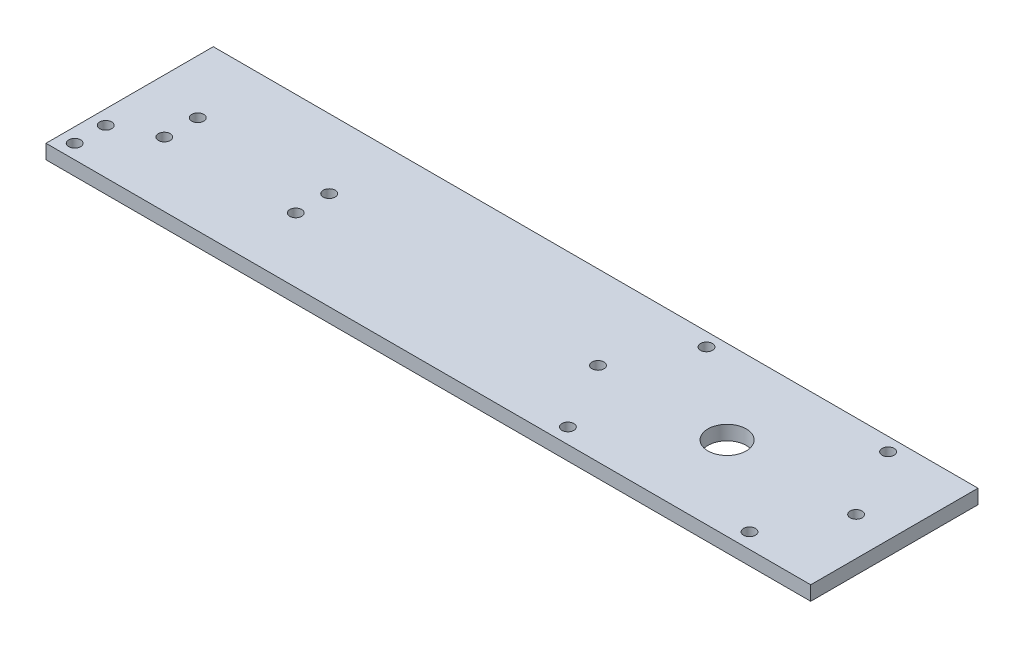
ISO-10303-21;
HEADER;
FILE_DESCRIPTION(('STEP AP214'),'2;1');
FILE_NAME('part.step','',(''),(''),'','','');
FILE_SCHEMA(('AUTOMOTIVE_DESIGN { 1 0 10303 214 1 1 1 1 }'));
ENDSEC;
DATA;
#1=APPLICATION_CONTEXT('core data for automotive mechanical design processes');
#2=APPLICATION_PROTOCOL_DEFINITION('international standard','automotive_design',2000,#1);
#3=PRODUCT_CONTEXT('',#1,'mechanical');
#4=PRODUCT('Part','Part','',(#3));
#5=PRODUCT_RELATED_PRODUCT_CATEGORY('part','',(#4));
#6=PRODUCT_DEFINITION_FORMATION('','',#4);
#7=PRODUCT_DEFINITION_CONTEXT('part definition',#1,'design');
#8=PRODUCT_DEFINITION('design','',#6,#7);
#9=PRODUCT_DEFINITION_SHAPE('','',#8);
#10=(LENGTH_UNIT() NAMED_UNIT(*) SI_UNIT(.MILLI.,.METRE.));
#11=(NAMED_UNIT(*) PLANE_ANGLE_UNIT() SI_UNIT($,.RADIAN.));
#12=(NAMED_UNIT(*) SI_UNIT($,.STERADIAN.) SOLID_ANGLE_UNIT());
#13=UNCERTAINTY_MEASURE_WITH_UNIT(LENGTH_MEASURE(1.E-05),#10,'distance_accuracy_value','');
#14=(GEOMETRIC_REPRESENTATION_CONTEXT(3) GLOBAL_UNCERTAINTY_ASSIGNED_CONTEXT((#13)) GLOBAL_UNIT_ASSIGNED_CONTEXT((#10,
#11,#12)) REPRESENTATION_CONTEXT('',''));
#15=CARTESIAN_POINT('',(0.,0.,0.));
#16=DIRECTION('',(0.,0.,1.));
#17=DIRECTION('',(1.,0.,0.));
#18=AXIS2_PLACEMENT_3D('',#15,#16,#17);
#19=CARTESIAN_POINT('',(0.,3.,12.5));
#20=DIRECTION('',(0.,0.,-1.));
#21=DIRECTION('',(-1.,0.,0.));
#22=AXIS2_PLACEMENT_3D('',#19,#20,#21);
#23=PLANE('',#22);
#24=DIRECTION('',(1.,0.,0.));
#25=VECTOR('',#24,1.);
#26=CARTESIAN_POINT('',(0.,0.,12.5));
#27=LINE('',#26,#25);
#28=CARTESIAN_POINT('',(-100.,0.,12.5));
#29=VERTEX_POINT('',#28);
#30=CARTESIAN_POINT('',(60.,0.,12.5));
#31=VERTEX_POINT('',#30);
#32=EDGE_CURVE('E150',#29,#31,#27,.T.);
#33=ORIENTED_EDGE('',*,*,#32,.T.);
#34=DIRECTION('',(0.,-1.,0.));
#35=VECTOR('',#34,1.);
#36=CARTESIAN_POINT('',(60.,3.,12.5));
#37=LINE('',#36,#35);
#38=CARTESIAN_POINT('',(60.,3.,12.5));
#39=VERTEX_POINT('',#38);
#40=EDGE_CURVE('E11',#39,#31,#37,.T.);
#41=ORIENTED_EDGE('',*,*,#40,.F.);
#42=DIRECTION('',(1.,0.,0.));
#43=VECTOR('',#42,1.);
#44=CARTESIAN_POINT('',(0.,3.,12.5));
#45=LINE('',#44,#43);
#46=CARTESIAN_POINT('',(-100.,3.,12.5));
#47=VERTEX_POINT('',#46);
#48=EDGE_CURVE('E85',#47,#39,#45,.T.);
#49=ORIENTED_EDGE('',*,*,#48,.F.);
#50=DIRECTION('',(0.,-1.,0.));
#51=VECTOR('',#50,1.);
#52=CARTESIAN_POINT('',(-100.,3.,12.5));
#53=LINE('',#52,#51);
#54=EDGE_CURVE('E149',#47,#29,#53,.T.);
#55=ORIENTED_EDGE('',*,*,#54,.T.);
#56=EDGE_LOOP('',(#33,#41,#49,#55));
#57=FACE_BOUND('',#56,.T.);
#58=ADVANCED_FACE('F43',(#57),#23,.F.);
#59=CARTESIAN_POINT('',(60.,3.,0.));
#60=DIRECTION('',(1.,0.,0.));
#61=DIRECTION('',(0.,0.,-1.));
#62=AXIS2_PLACEMENT_3D('',#59,#60,#61);
#63=PLANE('',#62);
#64=DIRECTION('',(0.,0.,1.));
#65=VECTOR('',#64,1.);
#66=CARTESIAN_POINT('',(60.,0.,0.));
#67=LINE('',#66,#65);
#68=CARTESIAN_POINT('',(60.,0.,-22.5));
#69=VERTEX_POINT('',#68);
#70=EDGE_CURVE('E94',#69,#31,#67,.T.);
#71=ORIENTED_EDGE('',*,*,#70,.F.);
#72=DIRECTION('',(0.,-1.,0.));
#73=VECTOR('',#72,1.);
#74=CARTESIAN_POINT('',(60.,3.,-22.5));
#75=LINE('',#74,#73);
#76=CARTESIAN_POINT('',(60.,3.,-22.5));
#77=VERTEX_POINT('',#76);
#78=EDGE_CURVE('E53',#77,#69,#75,.T.);
#79=ORIENTED_EDGE('',*,*,#78,.F.);
#80=DIRECTION('',(0.,0.,1.));
#81=VECTOR('',#80,1.);
#82=CARTESIAN_POINT('',(60.,3.,0.));
#83=LINE('',#82,#81);
#84=EDGE_CURVE('E92',#77,#39,#83,.T.);
#85=ORIENTED_EDGE('',*,*,#84,.T.);
#86=ORIENTED_EDGE('',*,*,#40,.T.);
#87=EDGE_LOOP('',(#71,#79,#85,#86));
#88=FACE_BOUND('',#87,.T.);
#89=ADVANCED_FACE('F91',(#88),#63,.T.);
#90=CARTESIAN_POINT('',(0.,3.,-22.5));
#91=DIRECTION('',(0.,0.,-1.));
#92=DIRECTION('',(-1.,0.,0.));
#93=AXIS2_PLACEMENT_3D('',#90,#91,#92);
#94=PLANE('',#93);
#95=DIRECTION('',(1.,0.,0.));
#96=VECTOR('',#95,1.);
#97=CARTESIAN_POINT('',(0.,0.,-22.5));
#98=LINE('',#97,#96);
#99=CARTESIAN_POINT('',(-100.,0.,-22.5));
#100=VERTEX_POINT('',#99);
#101=EDGE_CURVE('E156',#100,#69,#98,.T.);
#102=ORIENTED_EDGE('',*,*,#101,.F.);
#103=DIRECTION('',(0.,-1.,0.));
#104=VECTOR('',#103,1.);
#105=CARTESIAN_POINT('',(-100.,3.,-22.5));
#106=LINE('',#105,#104);
#107=CARTESIAN_POINT('',(-100.,3.,-22.5));
#108=VERTEX_POINT('',#107);
#109=EDGE_CURVE('E77',#108,#100,#106,.T.);
#110=ORIENTED_EDGE('',*,*,#109,.F.);
#111=DIRECTION('',(1.,0.,0.));
#112=VECTOR('',#111,1.);
#113=CARTESIAN_POINT('',(0.,3.,-22.5));
#114=LINE('',#113,#112);
#115=EDGE_CURVE('E103',#108,#77,#114,.T.);
#116=ORIENTED_EDGE('',*,*,#115,.T.);
#117=ORIENTED_EDGE('',*,*,#78,.T.);
#118=EDGE_LOOP('',(#102,#110,#116,#117));
#119=FACE_BOUND('',#118,.T.);
#120=ADVANCED_FACE('F106',(#119),#94,.T.);
#121=CARTESIAN_POINT('',(52.,3.,-5.));
#122=DIRECTION('',(0.,-1.,0.));
#123=DIRECTION('',(0.,0.,-1.));
#124=AXIS2_PLACEMENT_3D('',#121,#122,#123);
#125=CYLINDRICAL_SURFACE('',#124,1.25);
#126=CARTESIAN_POINT('',(52.,3.,-5.));
#127=DIRECTION('',(0.,1.,0.));
#128=DIRECTION('',(0.,0.,1.));
#129=AXIS2_PLACEMENT_3D('',#126,#127,#128);
#130=CIRCLE('',#129,1.25);
#131=CARTESIAN_POINT('',(52.,3.,-3.75000000000001));
#132=VERTEX_POINT('',#131);
#133=EDGE_CURVE('E141',#132,#132,#130,.T.);
#134=ORIENTED_EDGE('',*,*,#133,.T.);
#135=EDGE_LOOP('',(#134));
#136=FACE_BOUND('',#135,.T.);
#137=CARTESIAN_POINT('',(52.,0.,-5.));
#138=DIRECTION('',(0.,1.,0.));
#139=DIRECTION('',(0.,0.,1.));
#140=AXIS2_PLACEMENT_3D('',#137,#138,#139);
#141=CIRCLE('',#140,1.25);
#142=CARTESIAN_POINT('',(52.,0.,-3.75000000000001));
#143=VERTEX_POINT('',#142);
#144=EDGE_CURVE('E189',#143,#143,#141,.T.);
#145=ORIENTED_EDGE('',*,*,#144,.F.);
#146=EDGE_LOOP('',(#145));
#147=FACE_BOUND('',#146,.T.);
#148=ADVANCED_FACE('F420',(#136,#147),#125,.F.);
#149=CARTESIAN_POINT('',(25.,3.,-5.));
#150=DIRECTION('',(0.,-1.,0.));
#151=DIRECTION('',(0.,0.,-1.));
#152=AXIS2_PLACEMENT_3D('',#149,#150,#151);
#153=CYLINDRICAL_SURFACE('',#152,4.);
#154=CARTESIAN_POINT('',(25.,3.,-5.));
#155=DIRECTION('',(0.,1.,0.));
#156=DIRECTION('',(0.,0.,1.));
#157=AXIS2_PLACEMENT_3D('',#154,#155,#156);
#158=CIRCLE('',#157,4.);
#159=CARTESIAN_POINT('',(25.,3.,-1.));
#160=VERTEX_POINT('',#159);
#161=EDGE_CURVE('E137',#160,#160,#158,.T.);
#162=ORIENTED_EDGE('',*,*,#161,.T.);
#163=EDGE_LOOP('',(#162));
#164=FACE_BOUND('',#163,.T.);
#165=CARTESIAN_POINT('',(25.,0.,-5.));
#166=DIRECTION('',(0.,1.,0.));
#167=DIRECTION('',(0.,0.,1.));
#168=AXIS2_PLACEMENT_3D('',#165,#166,#167);
#169=CIRCLE('',#168,4.);
#170=CARTESIAN_POINT('',(25.,0.,-1.));
#171=VERTEX_POINT('',#170);
#172=EDGE_CURVE('E185',#171,#171,#169,.T.);
#173=ORIENTED_EDGE('',*,*,#172,.F.);
#174=EDGE_LOOP('',(#173));
#175=FACE_BOUND('',#174,.T.);
#176=ADVANCED_FACE('F410',(#164,#175),#153,.F.);
#177=CARTESIAN_POINT('',(-97.,3.,9.5));
#178=DIRECTION('',(0.,-1.,0.));
#179=DIRECTION('',(0.,0.,-1.));
#180=AXIS2_PLACEMENT_3D('',#177,#178,#179);
#181=CYLINDRICAL_SURFACE('',#180,1.25);
#182=CARTESIAN_POINT('',(-97.,3.,9.5));
#183=DIRECTION('',(0.,1.,0.));
#184=DIRECTION('',(0.,0.,1.));
#185=AXIS2_PLACEMENT_3D('',#182,#183,#184);
#186=CIRCLE('',#185,1.25);
#187=CARTESIAN_POINT('',(-97.,3.,10.75));
#188=VERTEX_POINT('',#187);
#189=EDGE_CURVE('E133',#188,#188,#186,.T.);
#190=ORIENTED_EDGE('',*,*,#189,.T.);
#191=EDGE_LOOP('',(#190));
#192=FACE_BOUND('',#191,.T.);
#193=CARTESIAN_POINT('',(-97.,0.,9.5));
#194=DIRECTION('',(0.,1.,0.));
#195=DIRECTION('',(0.,0.,1.));
#196=AXIS2_PLACEMENT_3D('',#193,#194,#195);
#197=CIRCLE('',#196,1.25);
#198=CARTESIAN_POINT('',(-97.,0.,10.75));
#199=VERTEX_POINT('',#198);
#200=EDGE_CURVE('E181',#199,#199,#197,.T.);
#201=ORIENTED_EDGE('',*,*,#200,.F.);
#202=EDGE_LOOP('',(#201));
#203=FACE_BOUND('',#202,.T.);
#204=ADVANCED_FACE('F400',(#192,#203),#181,.F.);
#205=CARTESIAN_POINT('',(-97.,3.,3.));
#206=DIRECTION('',(0.,-1.,0.));
#207=DIRECTION('',(0.,0.,-1.));
#208=AXIS2_PLACEMENT_3D('',#205,#206,#207);
#209=CYLINDRICAL_SURFACE('',#208,1.25);
#210=CARTESIAN_POINT('',(-97.,3.,3.));
#211=DIRECTION('',(0.,1.,0.));
#212=DIRECTION('',(0.,0.,1.));
#213=AXIS2_PLACEMENT_3D('',#210,#211,#212);
#214=CIRCLE('',#213,1.25);
#215=CARTESIAN_POINT('',(-97.,3.,4.25));
#216=VERTEX_POINT('',#215);
#217=EDGE_CURVE('E129',#216,#216,#214,.T.);
#218=ORIENTED_EDGE('',*,*,#217,.T.);
#219=EDGE_LOOP('',(#218));
#220=FACE_BOUND('',#219,.T.);
#221=CARTESIAN_POINT('',(-97.,0.,3.));
#222=DIRECTION('',(0.,1.,0.));
#223=DIRECTION('',(0.,0.,1.));
#224=AXIS2_PLACEMENT_3D('',#221,#222,#223);
#225=CIRCLE('',#224,1.25);
#226=CARTESIAN_POINT('',(-97.,0.,4.25));
#227=VERTEX_POINT('',#226);
#228=EDGE_CURVE('E177',#227,#227,#225,.T.);
#229=ORIENTED_EDGE('',*,*,#228,.F.);
#230=EDGE_LOOP('',(#229));
#231=FACE_BOUND('',#230,.T.);
#232=ADVANCED_FACE('F390',(#220,#231),#209,.F.);
#233=CARTESIAN_POINT('',(-88.75,3.,-8.));
#234=DIRECTION('',(0.,-1.,0.));
#235=DIRECTION('',(0.,0.,-1.));
#236=AXIS2_PLACEMENT_3D('',#233,#234,#235);
#237=CYLINDRICAL_SURFACE('',#236,1.25);
#238=CARTESIAN_POINT('',(-88.75,3.,-8.));
#239=DIRECTION('',(0.,1.,0.));
#240=DIRECTION('',(0.,0.,1.));
#241=AXIS2_PLACEMENT_3D('',#238,#239,#240);
#242=CIRCLE('',#241,1.25);
#243=CARTESIAN_POINT('',(-88.75,3.,-6.75));
#244=VERTEX_POINT('',#243);
#245=EDGE_CURVE('E125',#244,#244,#242,.T.);
#246=ORIENTED_EDGE('',*,*,#245,.T.);
#247=EDGE_LOOP('',(#246));
#248=FACE_BOUND('',#247,.T.);
#249=CARTESIAN_POINT('',(-88.75,0.,-8.));
#250=DIRECTION('',(0.,1.,0.));
#251=DIRECTION('',(0.,0.,1.));
#252=AXIS2_PLACEMENT_3D('',#249,#250,#251);
#253=CIRCLE('',#252,1.25);
#254=CARTESIAN_POINT('',(-88.75,0.,-6.75));
#255=VERTEX_POINT('',#254);
#256=EDGE_CURVE('E173',#255,#255,#253,.T.);
#257=ORIENTED_EDGE('',*,*,#256,.F.);
#258=EDGE_LOOP('',(#257));
#259=FACE_BOUND('',#258,.T.);
#260=ADVANCED_FACE('F380',(#248,#259),#237,.F.);
#261=CARTESIAN_POINT('',(-61.25,3.,-8.));
#262=DIRECTION('',(0.,-1.,0.));
#263=DIRECTION('',(0.,0.,-1.));
#264=AXIS2_PLACEMENT_3D('',#261,#262,#263);
#265=CYLINDRICAL_SURFACE('',#264,1.25);
#266=CARTESIAN_POINT('',(-61.25,3.,-8.));
#267=DIRECTION('',(0.,1.,0.));
#268=DIRECTION('',(0.,0.,1.));
#269=AXIS2_PLACEMENT_3D('',#266,#267,#268);
#270=CIRCLE('',#269,1.25);
#271=CARTESIAN_POINT('',(-61.25,3.,-6.75));
#272=VERTEX_POINT('',#271);
#273=EDGE_CURVE('E121',#272,#272,#270,.T.);
#274=ORIENTED_EDGE('',*,*,#273,.T.);
#275=EDGE_LOOP('',(#274));
#276=FACE_BOUND('',#275,.T.);
#277=CARTESIAN_POINT('',(-61.25,0.,-8.));
#278=DIRECTION('',(0.,1.,0.));
#279=DIRECTION('',(0.,0.,1.));
#280=AXIS2_PLACEMENT_3D('',#277,#278,#279);
#281=CIRCLE('',#280,1.25);
#282=CARTESIAN_POINT('',(-61.25,0.,-6.75));
#283=VERTEX_POINT('',#282);
#284=EDGE_CURVE('E169',#283,#283,#281,.T.);
#285=ORIENTED_EDGE('',*,*,#284,.F.);
#286=EDGE_LOOP('',(#285));
#287=FACE_BOUND('',#286,.T.);
#288=ADVANCED_FACE('F370',(#276,#287),#265,.F.);
#289=CARTESIAN_POINT('',(-61.25,3.,-1.));
#290=DIRECTION('',(0.,-1.,0.));
#291=DIRECTION('',(0.,0.,-1.));
#292=AXIS2_PLACEMENT_3D('',#289,#290,#291);
#293=CYLINDRICAL_SURFACE('',#292,1.25);
#294=CARTESIAN_POINT('',(-61.25,3.,-1.));
#295=DIRECTION('',(0.,1.,0.));
#296=DIRECTION('',(0.,0.,1.));
#297=AXIS2_PLACEMENT_3D('',#294,#295,#296);
#298=CIRCLE('',#297,1.25);
#299=CARTESIAN_POINT('',(-61.25,3.,0.249999999999996));
#300=VERTEX_POINT('',#299);
#301=EDGE_CURVE('E117',#300,#300,#298,.T.);
#302=ORIENTED_EDGE('',*,*,#301,.T.);
#303=EDGE_LOOP('',(#302));
#304=FACE_BOUND('',#303,.T.);
#305=CARTESIAN_POINT('',(-61.25,0.,-1.));
#306=DIRECTION('',(0.,1.,0.));
#307=DIRECTION('',(0.,0.,1.));
#308=AXIS2_PLACEMENT_3D('',#305,#306,#307);
#309=CIRCLE('',#308,1.25);
#310=CARTESIAN_POINT('',(-61.25,0.,0.249999999999996));
#311=VERTEX_POINT('',#310);
#312=EDGE_CURVE('E165',#311,#311,#309,.T.);
#313=ORIENTED_EDGE('',*,*,#312,.F.);
#314=EDGE_LOOP('',(#313));
#315=FACE_BOUND('',#314,.T.);
#316=ADVANCED_FACE('F360',(#304,#315),#293,.F.);
#317=CARTESIAN_POINT('',(-88.75,3.,-1.));
#318=DIRECTION('',(0.,-1.,0.));
#319=DIRECTION('',(0.,0.,-1.));
#320=AXIS2_PLACEMENT_3D('',#317,#318,#319);
#321=CYLINDRICAL_SURFACE('',#320,1.25);
#322=CARTESIAN_POINT('',(-88.75,3.,-1.));
#323=DIRECTION('',(0.,1.,0.));
#324=DIRECTION('',(0.,0.,1.));
#325=AXIS2_PLACEMENT_3D('',#322,#323,#324);
#326=CIRCLE('',#325,1.25);
#327=CARTESIAN_POINT('',(-88.75,3.,0.249999999999996));
#328=VERTEX_POINT('',#327);
#329=EDGE_CURVE('E110',#328,#328,#326,.T.);
#330=ORIENTED_EDGE('',*,*,#329,.T.);
#331=EDGE_LOOP('',(#330));
#332=FACE_BOUND('',#331,.T.);
#333=CARTESIAN_POINT('',(-88.75,0.,-1.));
#334=DIRECTION('',(0.,1.,0.));
#335=DIRECTION('',(0.,0.,1.));
#336=AXIS2_PLACEMENT_3D('',#333,#334,#335);
#337=CIRCLE('',#336,1.25);
#338=CARTESIAN_POINT('',(-88.75,0.,0.249999999999996));
#339=VERTEX_POINT('',#338);
#340=EDGE_CURVE('E161',#339,#339,#337,.T.);
#341=ORIENTED_EDGE('',*,*,#340,.F.);
#342=EDGE_LOOP('',(#341));
#343=FACE_BOUND('',#342,.T.);
#344=ADVANCED_FACE('F261',(#332,#343),#321,.F.);
#345=CARTESIAN_POINT('',(-100.,3.,0.));
#346=DIRECTION('',(1.,0.,0.));
#347=DIRECTION('',(0.,0.,-1.));
#348=AXIS2_PLACEMENT_3D('',#345,#346,#347);
#349=PLANE('',#348);
#350=DIRECTION('',(0.,0.,1.));
#351=VECTOR('',#350,1.);
#352=CARTESIAN_POINT('',(-100.,0.,0.));
#353=LINE('',#352,#351);
#354=EDGE_CURVE('E80',#100,#29,#353,.T.);
#355=ORIENTED_EDGE('',*,*,#354,.T.);
#356=ORIENTED_EDGE('',*,*,#54,.F.);
#357=DIRECTION('',(0.,0.,1.));
#358=VECTOR('',#357,1.);
#359=CARTESIAN_POINT('',(-100.,3.,0.));
#360=LINE('',#359,#358);
#361=EDGE_CURVE('E62',#108,#47,#360,.T.);
#362=ORIENTED_EDGE('',*,*,#361,.F.);
#363=ORIENTED_EDGE('',*,*,#109,.T.);
#364=EDGE_LOOP('',(#355,#356,#362,#363));
#365=FACE_BOUND('',#364,.T.);
#366=ADVANCED_FACE('F252',(#365),#349,.F.);
#367=CARTESIAN_POINT('',(-1.99999999999999,3.,-5.));
#368=DIRECTION('',(0.,-1.,0.));
#369=DIRECTION('',(0.,0.,-1.));
#370=AXIS2_PLACEMENT_3D('',#367,#368,#369);
#371=CYLINDRICAL_SURFACE('',#370,1.25);
#372=CARTESIAN_POINT('',(-1.99999999999999,3.,-5.));
#373=DIRECTION('',(0.,1.,0.));
#374=DIRECTION('',(0.,0.,1.));
#375=AXIS2_PLACEMENT_3D('',#372,#373,#374);
#376=CIRCLE('',#375,1.25);
#377=CARTESIAN_POINT('',(-1.99999999999999,3.,-3.74999999999999));
#378=VERTEX_POINT('',#377);
#379=EDGE_CURVE('E145',#378,#378,#376,.F.);
#380=ORIENTED_EDGE('',*,*,#379,.F.);
#381=EDGE_LOOP('',(#380));
#382=FACE_BOUND('',#381,.T.);
#383=CARTESIAN_POINT('',(-1.99999999999999,0.,-5.));
#384=DIRECTION('',(0.,1.,0.));
#385=DIRECTION('',(0.,0.,1.));
#386=AXIS2_PLACEMENT_3D('',#383,#384,#385);
#387=CIRCLE('',#386,1.25);
#388=CARTESIAN_POINT('',(-1.99999999999999,0.,-3.74999999999999));
#389=VERTEX_POINT('',#388);
#390=EDGE_CURVE('E193',#389,#389,#387,.F.);
#391=ORIENTED_EDGE('',*,*,#390,.T.);
#392=EDGE_LOOP('',(#391));
#393=FACE_BOUND('',#392,.T.);
#394=ADVANCED_FACE('F250',(#382,#393),#371,.F.);
#395=CARTESIAN_POINT('',(0.,3.,0.));
#396=DIRECTION('',(0.,1.,0.));
#397=DIRECTION('',(0.,0.,1.));
#398=AXIS2_PLACEMENT_3D('',#395,#396,#397);
#399=PLANE('',#398);
#400=CARTESIAN_POINT('',(6.00000000000002,3.,9.30763797671848));
#401=DIRECTION('',(0.,-1.,0.));
#402=DIRECTION('',(0.,0.,-1.));
#403=AXIS2_PLACEMENT_3D('',#400,#401,#402);
#404=CIRCLE('',#403,1.25);
#405=CARTESIAN_POINT('',(6.00000000000002,3.,8.05763797671848));
#406=VERTEX_POINT('',#405);
#407=EDGE_CURVE('E276',#406,#406,#404,.T.);
#408=ORIENTED_EDGE('',*,*,#407,.T.);
#409=EDGE_LOOP('',(#408));
#410=FACE_BOUND('',#409,.T.);
#411=CARTESIAN_POINT('',(6.00000000000012,3.,-19.6923620232807));
#412=DIRECTION('',(0.,-1.,0.));
#413=DIRECTION('',(0.,0.,-1.));
#414=AXIS2_PLACEMENT_3D('',#411,#412,#413);
#415=CIRCLE('',#414,1.25);
#416=CARTESIAN_POINT('',(6.00000000000012,3.,-20.9423620232807));
#417=VERTEX_POINT('',#416);
#418=EDGE_CURVE('E280',#417,#417,#415,.T.);
#419=ORIENTED_EDGE('',*,*,#418,.T.);
#420=EDGE_LOOP('',(#419));
#421=FACE_BOUND('',#420,.T.);
#422=CARTESIAN_POINT('',(44.0000000000001,3.,-19.6923620232807));
#423=DIRECTION('',(0.,-1.,0.));
#424=DIRECTION('',(0.,0.,-1.));
#425=AXIS2_PLACEMENT_3D('',#422,#423,#424);
#426=CIRCLE('',#425,1.25);
#427=CARTESIAN_POINT('',(44.0000000000001,3.,-20.9423620232807));
#428=VERTEX_POINT('',#427);
#429=EDGE_CURVE('E275',#428,#428,#426,.T.);
#430=ORIENTED_EDGE('',*,*,#429,.T.);
#431=EDGE_LOOP('',(#430));
#432=FACE_BOUND('',#431,.T.);
#433=CARTESIAN_POINT('',(44.,3.,9.3076379767184));
#434=DIRECTION('',(0.,-1.,0.));
#435=DIRECTION('',(0.,0.,-1.));
#436=AXIS2_PLACEMENT_3D('',#433,#434,#435);
#437=CIRCLE('',#436,1.24999999999973);
#438=CARTESIAN_POINT('',(44.,3.,8.05763797671867));
#439=VERTEX_POINT('',#438);
#440=EDGE_CURVE('E206',#439,#439,#437,.T.);
#441=ORIENTED_EDGE('',*,*,#440,.T.);
#442=EDGE_LOOP('',(#441));
#443=FACE_BOUND('',#442,.T.);
#444=ORIENTED_EDGE('',*,*,#48,.T.);
#445=ORIENTED_EDGE('',*,*,#84,.F.);
#446=ORIENTED_EDGE('',*,*,#115,.F.);
#447=ORIENTED_EDGE('',*,*,#361,.T.);
#448=EDGE_LOOP('',(#444,#445,#446,#447));
#449=FACE_BOUND('',#448,.T.);
#450=ORIENTED_EDGE('',*,*,#329,.F.);
#451=EDGE_LOOP('',(#450));
#452=FACE_BOUND('',#451,.T.);
#453=ORIENTED_EDGE('',*,*,#301,.F.);
#454=EDGE_LOOP('',(#453));
#455=FACE_BOUND('',#454,.T.);
#456=ORIENTED_EDGE('',*,*,#273,.F.);
#457=EDGE_LOOP('',(#456));
#458=FACE_BOUND('',#457,.T.);
#459=ORIENTED_EDGE('',*,*,#245,.F.);
#460=EDGE_LOOP('',(#459));
#461=FACE_BOUND('',#460,.T.);
#462=ORIENTED_EDGE('',*,*,#217,.F.);
#463=EDGE_LOOP('',(#462));
#464=FACE_BOUND('',#463,.T.);
#465=ORIENTED_EDGE('',*,*,#189,.F.);
#466=EDGE_LOOP('',(#465));
#467=FACE_BOUND('',#466,.T.);
#468=ORIENTED_EDGE('',*,*,#161,.F.);
#469=EDGE_LOOP('',(#468));
#470=FACE_BOUND('',#469,.T.);
#471=ORIENTED_EDGE('',*,*,#133,.F.);
#472=EDGE_LOOP('',(#471));
#473=FACE_BOUND('',#472,.T.);
#474=ORIENTED_EDGE('',*,*,#379,.T.);
#475=EDGE_LOOP('',(#474));
#476=FACE_BOUND('',#475,.T.);
#477=ADVANCED_FACE('F101',(#410,#421,#432,#443,#449,#452,#455,#458,#461,#464,#467,#470,#473,
#476),#399,.T.);
#478=CARTESIAN_POINT('',(0.,0.,0.));
#479=DIRECTION('',(0.,1.,0.));
#480=DIRECTION('',(0.,0.,1.));
#481=AXIS2_PLACEMENT_3D('',#478,#479,#480);
#482=PLANE('',#481);
#483=CARTESIAN_POINT('',(6.00000000000002,0.,9.30763797671848));
#484=DIRECTION('',(0.,1.,0.));
#485=DIRECTION('',(0.,0.,1.));
#486=AXIS2_PLACEMENT_3D('',#483,#484,#485);
#487=CIRCLE('',#486,1.25);
#488=CARTESIAN_POINT('',(6.00000000000002,0.,10.5576379767185));
#489=VERTEX_POINT('',#488);
#490=EDGE_CURVE('E46',#489,#489,#487,.F.);
#491=ORIENTED_EDGE('',*,*,#490,.F.);
#492=EDGE_LOOP('',(#491));
#493=FACE_BOUND('',#492,.T.);
#494=CARTESIAN_POINT('',(6.00000000000012,0.,-19.6923620232807));
#495=DIRECTION('',(0.,1.,0.));
#496=DIRECTION('',(0.,0.,1.));
#497=AXIS2_PLACEMENT_3D('',#494,#495,#496);
#498=CIRCLE('',#497,1.25);
#499=CARTESIAN_POINT('',(6.00000000000012,0.,-18.4423620232807));
#500=VERTEX_POINT('',#499);
#501=EDGE_CURVE('E209',#500,#500,#498,.F.);
#502=ORIENTED_EDGE('',*,*,#501,.F.);
#503=EDGE_LOOP('',(#502));
#504=FACE_BOUND('',#503,.T.);
#505=CARTESIAN_POINT('',(44.0000000000001,0.,-19.6923620232807));
#506=DIRECTION('',(0.,1.,0.));
#507=DIRECTION('',(0.,0.,1.));
#508=AXIS2_PLACEMENT_3D('',#505,#506,#507);
#509=CIRCLE('',#508,1.25);
#510=CARTESIAN_POINT('',(44.0000000000001,0.,-18.4423620232807));
#511=VERTEX_POINT('',#510);
#512=EDGE_CURVE('E205',#511,#511,#509,.F.);
#513=ORIENTED_EDGE('',*,*,#512,.F.);
#514=EDGE_LOOP('',(#513));
#515=FACE_BOUND('',#514,.T.);
#516=CARTESIAN_POINT('',(44.,0.,9.3076379767184));
#517=DIRECTION('',(0.,1.,0.));
#518=DIRECTION('',(0.,0.,1.));
#519=AXIS2_PLACEMENT_3D('',#516,#517,#518);
#520=CIRCLE('',#519,1.24999999999973);
#521=CARTESIAN_POINT('',(44.,0.,10.5576379767181));
#522=VERTEX_POINT('',#521);
#523=EDGE_CURVE('E201',#522,#522,#520,.F.);
#524=ORIENTED_EDGE('',*,*,#523,.F.);
#525=EDGE_LOOP('',(#524));
#526=FACE_BOUND('',#525,.T.);
#527=ORIENTED_EDGE('',*,*,#32,.F.);
#528=ORIENTED_EDGE('',*,*,#354,.F.);
#529=ORIENTED_EDGE('',*,*,#101,.T.);
#530=ORIENTED_EDGE('',*,*,#70,.T.);
#531=EDGE_LOOP('',(#527,#528,#529,#530));
#532=FACE_BOUND('',#531,.T.);
#533=ORIENTED_EDGE('',*,*,#340,.T.);
#534=EDGE_LOOP('',(#533));
#535=FACE_BOUND('',#534,.T.);
#536=ORIENTED_EDGE('',*,*,#312,.T.);
#537=EDGE_LOOP('',(#536));
#538=FACE_BOUND('',#537,.T.);
#539=ORIENTED_EDGE('',*,*,#284,.T.);
#540=EDGE_LOOP('',(#539));
#541=FACE_BOUND('',#540,.T.);
#542=ORIENTED_EDGE('',*,*,#256,.T.);
#543=EDGE_LOOP('',(#542));
#544=FACE_BOUND('',#543,.T.);
#545=ORIENTED_EDGE('',*,*,#228,.T.);
#546=EDGE_LOOP('',(#545));
#547=FACE_BOUND('',#546,.T.);
#548=ORIENTED_EDGE('',*,*,#200,.T.);
#549=EDGE_LOOP('',(#548));
#550=FACE_BOUND('',#549,.T.);
#551=ORIENTED_EDGE('',*,*,#172,.T.);
#552=EDGE_LOOP('',(#551));
#553=FACE_BOUND('',#552,.T.);
#554=ORIENTED_EDGE('',*,*,#144,.T.);
#555=EDGE_LOOP('',(#554));
#556=FACE_BOUND('',#555,.T.);
#557=ORIENTED_EDGE('',*,*,#390,.F.);
#558=EDGE_LOOP('',(#557));
#559=FACE_BOUND('',#558,.T.);
#560=ADVANCED_FACE('F220',(#493,#504,#515,#526,#532,#535,#538,#541,#544,#547,#550,#553,#556,
#559),#482,.F.);
#561=CARTESIAN_POINT('',(44.,-7.,9.3076379767184));
#562=DIRECTION('',(0.,1.,0.));
#563=DIRECTION('',(0.,0.,1.));
#564=AXIS2_PLACEMENT_3D('',#561,#562,#563);
#565=CYLINDRICAL_SURFACE('',#564,1.24999999999973);
#566=ORIENTED_EDGE('',*,*,#440,.F.);
#567=EDGE_LOOP('',(#566));
#568=FACE_BOUND('',#567,.T.);
#569=ORIENTED_EDGE('',*,*,#523,.T.);
#570=EDGE_LOOP('',(#569));
#571=FACE_BOUND('',#570,.T.);
#572=ADVANCED_FACE('F223',(#568,#571),#565,.F.);
#573=CARTESIAN_POINT('',(44.0000000000001,-7.,-19.6923620232807));
#574=DIRECTION('',(0.,1.,0.));
#575=DIRECTION('',(0.,0.,1.));
#576=AXIS2_PLACEMENT_3D('',#573,#574,#575);
#577=CYLINDRICAL_SURFACE('',#576,1.25);
#578=ORIENTED_EDGE('',*,*,#429,.F.);
#579=EDGE_LOOP('',(#578));
#580=FACE_BOUND('',#579,.T.);
#581=ORIENTED_EDGE('',*,*,#512,.T.);
#582=EDGE_LOOP('',(#581));
#583=FACE_BOUND('',#582,.T.);
#584=ADVANCED_FACE('F290',(#580,#583),#577,.F.);
#585=CARTESIAN_POINT('',(6.00000000000012,-7.,-19.6923620232807));
#586=DIRECTION('',(0.,1.,0.));
#587=DIRECTION('',(0.,0.,1.));
#588=AXIS2_PLACEMENT_3D('',#585,#586,#587);
#589=CYLINDRICAL_SURFACE('',#588,1.25);
#590=ORIENTED_EDGE('',*,*,#418,.F.);
#591=EDGE_LOOP('',(#590));
#592=FACE_BOUND('',#591,.T.);
#593=ORIENTED_EDGE('',*,*,#501,.T.);
#594=EDGE_LOOP('',(#593));
#595=FACE_BOUND('',#594,.T.);
#596=ADVANCED_FACE('F293',(#592,#595),#589,.F.);
#597=CARTESIAN_POINT('',(6.00000000000002,-7.,9.30763797671848));
#598=DIRECTION('',(0.,1.,0.));
#599=DIRECTION('',(0.,0.,1.));
#600=AXIS2_PLACEMENT_3D('',#597,#598,#599);
#601=CYLINDRICAL_SURFACE('',#600,1.25);
#602=ORIENTED_EDGE('',*,*,#407,.F.);
#603=EDGE_LOOP('',(#602));
#604=FACE_BOUND('',#603,.T.);
#605=ORIENTED_EDGE('',*,*,#490,.T.);
#606=EDGE_LOOP('',(#605));
#607=FACE_BOUND('',#606,.T.);
#608=ADVANCED_FACE('F218',(#604,#607),#601,.F.);
#609=CLOSED_SHELL('',(#58,#89,#120,#148,#176,#204,#232,#260,#288,#316,#344,#366,#394,#477,#560,
#572,#584,#596,#608));
#610=MANIFOLD_SOLID_BREP('B2',#609);
#611=ADVANCED_BREP_SHAPE_REPRESENTATION('',(#18,#610),#14);
#612=SHAPE_DEFINITION_REPRESENTATION(#9,#611);
ENDSEC;
END-ISO-10303-21;
